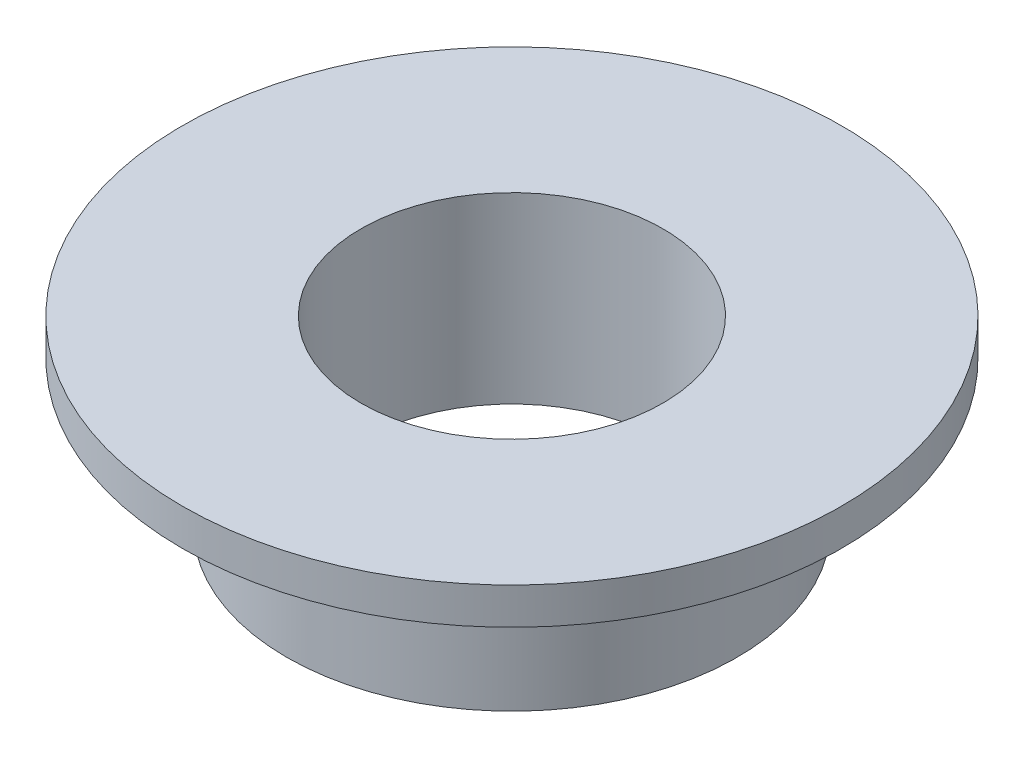
ISO-10303-21;
HEADER;
FILE_DESCRIPTION(('STEP AP214'),'2;1');
FILE_NAME('part.step','',(''),(''),'','','');
FILE_SCHEMA(('AUTOMOTIVE_DESIGN { 1 0 10303 214 1 1 1 1 }'));
ENDSEC;
DATA;
#1=APPLICATION_CONTEXT('core data for automotive mechanical design processes');
#2=APPLICATION_PROTOCOL_DEFINITION('international standard','automotive_design',2000,#1);
#3=PRODUCT_CONTEXT('',#1,'mechanical');
#4=PRODUCT('Part','Part','',(#3));
#5=PRODUCT_RELATED_PRODUCT_CATEGORY('part','',(#4));
#6=PRODUCT_DEFINITION_FORMATION('','',#4);
#7=PRODUCT_DEFINITION_CONTEXT('part definition',#1,'design');
#8=PRODUCT_DEFINITION('design','',#6,#7);
#9=PRODUCT_DEFINITION_SHAPE('','',#8);
#10=(LENGTH_UNIT() NAMED_UNIT(*) SI_UNIT(.MILLI.,.METRE.));
#11=(NAMED_UNIT(*) PLANE_ANGLE_UNIT() SI_UNIT($,.RADIAN.));
#12=(NAMED_UNIT(*) SI_UNIT($,.STERADIAN.) SOLID_ANGLE_UNIT());
#13=UNCERTAINTY_MEASURE_WITH_UNIT(LENGTH_MEASURE(1.E-05),#10,'distance_accuracy_value','');
#14=(GEOMETRIC_REPRESENTATION_CONTEXT(3) GLOBAL_UNCERTAINTY_ASSIGNED_CONTEXT((#13)) GLOBAL_UNIT_ASSIGNED_CONTEXT((#10,
#11,#12)) REPRESENTATION_CONTEXT('',''));
#15=CARTESIAN_POINT('',(0.,0.,0.));
#16=DIRECTION('',(0.,0.,1.));
#17=DIRECTION('',(1.,0.,0.));
#18=AXIS2_PLACEMENT_3D('',#15,#16,#17);
#19=CARTESIAN_POINT('',(0.,0.,0.));
#20=DIRECTION('',(0.,1.,0.));
#21=DIRECTION('',(0.,0.,1.));
#22=AXIS2_PLACEMENT_3D('',#19,#20,#21);
#23=PLANE('',#22);
#24=CARTESIAN_POINT('',(0.,0.,0.));
#25=DIRECTION('',(0.,1.,0.));
#26=DIRECTION('',(0.,0.,1.));
#27=AXIS2_PLACEMENT_3D('',#24,#25,#26);
#28=CIRCLE('',#27,6.15);
#29=CARTESIAN_POINT('',(0.,0.,6.15));
#30=VERTEX_POINT('',#29);
#31=EDGE_CURVE('E41',#30,#30,#28,.T.);
#32=ORIENTED_EDGE('',*,*,#31,.F.);
#33=EDGE_LOOP('',(#32));
#34=FACE_BOUND('',#33,.T.);
#35=CARTESIAN_POINT('',(0.,0.,0.));
#36=DIRECTION('',(0.,1.,0.));
#37=DIRECTION('',(0.,0.,1.));
#38=AXIS2_PLACEMENT_3D('',#35,#36,#37);
#39=CIRCLE('',#38,4.125);
#40=CARTESIAN_POINT('',(0.,0.,4.125));
#41=VERTEX_POINT('',#40);
#42=EDGE_CURVE('E48',#41,#41,#39,.T.);
#43=ORIENTED_EDGE('',*,*,#42,.T.);
#44=EDGE_LOOP('',(#43));
#45=FACE_BOUND('',#44,.T.);
#46=ADVANCED_FACE('F37',(#34,#45),#23,.F.);
#47=CARTESIAN_POINT('',(0.,4.,0.));
#48=DIRECTION('',(0.,-1.,0.));
#49=DIRECTION('',(0.,0.,-1.));
#50=AXIS2_PLACEMENT_3D('',#47,#48,#49);
#51=CYLINDRICAL_SURFACE('',#50,6.15);
#52=CARTESIAN_POINT('',(0.,4.,0.));
#53=DIRECTION('',(0.,1.,0.));
#54=DIRECTION('',(0.,0.,1.));
#55=AXIS2_PLACEMENT_3D('',#52,#53,#54);
#56=CIRCLE('',#55,6.15);
#57=CARTESIAN_POINT('',(0.,4.,6.15));
#58=VERTEX_POINT('',#57);
#59=EDGE_CURVE('E10',#58,#58,#56,.T.);
#60=ORIENTED_EDGE('',*,*,#59,.F.);
#61=EDGE_LOOP('',(#60));
#62=FACE_BOUND('',#61,.T.);
#63=ORIENTED_EDGE('',*,*,#31,.T.);
#64=EDGE_LOOP('',(#63));
#65=FACE_BOUND('',#64,.T.);
#66=ADVANCED_FACE('F39',(#62,#65),#51,.T.);
#67=CARTESIAN_POINT('',(0.,4.,0.));
#68=DIRECTION('',(0.,-1.,0.));
#69=DIRECTION('',(0.,0.,-1.));
#70=AXIS2_PLACEMENT_3D('',#67,#68,#69);
#71=CYLINDRICAL_SURFACE('',#70,4.125);
#72=ORIENTED_EDGE('',*,*,#42,.F.);
#73=EDGE_LOOP('',(#72));
#74=FACE_BOUND('',#73,.T.);
#75=CARTESIAN_POINT('',(0.,5.,0.));
#76=DIRECTION('',(0.,1.,0.));
#77=DIRECTION('',(0.,0.,1.));
#78=AXIS2_PLACEMENT_3D('',#75,#76,#77);
#79=CIRCLE('',#78,4.125);
#80=CARTESIAN_POINT('',(0.,5.,4.125));
#81=VERTEX_POINT('',#80);
#82=EDGE_CURVE('E56',#81,#81,#79,.T.);
#83=ORIENTED_EDGE('',*,*,#82,.T.);
#84=EDGE_LOOP('',(#83));
#85=FACE_BOUND('',#84,.T.);
#86=ADVANCED_FACE('F62',(#74,#85),#71,.F.);
#87=CARTESIAN_POINT('',(0.,5.,0.));
#88=DIRECTION('',(0.,1.,0.));
#89=DIRECTION('',(0.,0.,1.));
#90=AXIS2_PLACEMENT_3D('',#87,#88,#89);
#91=PLANE('',#90);
#92=CARTESIAN_POINT('',(0.,5.,0.));
#93=DIRECTION('',(0.,1.,0.));
#94=DIRECTION('',(0.,0.,1.));
#95=AXIS2_PLACEMENT_3D('',#92,#93,#94);
#96=CIRCLE('',#95,9.);
#97=CARTESIAN_POINT('',(0.,5.,9.));
#98=VERTEX_POINT('',#97);
#99=EDGE_CURVE('E52',#98,#98,#96,.T.);
#100=ORIENTED_EDGE('',*,*,#99,.T.);
#101=EDGE_LOOP('',(#100));
#102=FACE_BOUND('',#101,.T.);
#103=ORIENTED_EDGE('',*,*,#82,.F.);
#104=EDGE_LOOP('',(#103));
#105=FACE_BOUND('',#104,.T.);
#106=ADVANCED_FACE('F64',(#102,#105),#91,.T.);
#107=CARTESIAN_POINT('',(0.,4.,0.));
#108=DIRECTION('',(0.,1.,0.));
#109=DIRECTION('',(0.,0.,1.));
#110=AXIS2_PLACEMENT_3D('',#107,#108,#109);
#111=PLANE('',#110);
#112=ORIENTED_EDGE('',*,*,#59,.T.);
#113=EDGE_LOOP('',(#112));
#114=FACE_BOUND('',#113,.T.);
#115=CARTESIAN_POINT('',(0.,4.,0.));
#116=DIRECTION('',(0.,1.,0.));
#117=DIRECTION('',(0.,0.,1.));
#118=AXIS2_PLACEMENT_3D('',#115,#116,#117);
#119=CIRCLE('',#118,9.);
#120=CARTESIAN_POINT('',(0.,4.,9.));
#121=VERTEX_POINT('',#120);
#122=EDGE_CURVE('E53',#121,#121,#119,.T.);
#123=ORIENTED_EDGE('',*,*,#122,.F.);
#124=EDGE_LOOP('',(#123));
#125=FACE_BOUND('',#124,.T.);
#126=ADVANCED_FACE('F66',(#114,#125),#111,.F.);
#127=CARTESIAN_POINT('',(0.,5.,0.));
#128=DIRECTION('',(0.,-1.,0.));
#129=DIRECTION('',(0.,0.,-1.));
#130=AXIS2_PLACEMENT_3D('',#127,#128,#129);
#131=CYLINDRICAL_SURFACE('',#130,9.);
#132=ORIENTED_EDGE('',*,*,#99,.F.);
#133=EDGE_LOOP('',(#132));
#134=FACE_BOUND('',#133,.T.);
#135=ORIENTED_EDGE('',*,*,#122,.T.);
#136=EDGE_LOOP('',(#135));
#137=FACE_BOUND('',#136,.T.);
#138=ADVANCED_FACE('F73',(#134,#137),#131,.T.);
#139=CLOSED_SHELL('',(#46,#66,#86,#106,#126,#138));
#140=MANIFOLD_SOLID_BREP('B2',#139);
#141=ADVANCED_BREP_SHAPE_REPRESENTATION('',(#18,#140),#14);
#142=SHAPE_DEFINITION_REPRESENTATION(#9,#141);
ENDSEC;
END-ISO-10303-21;
